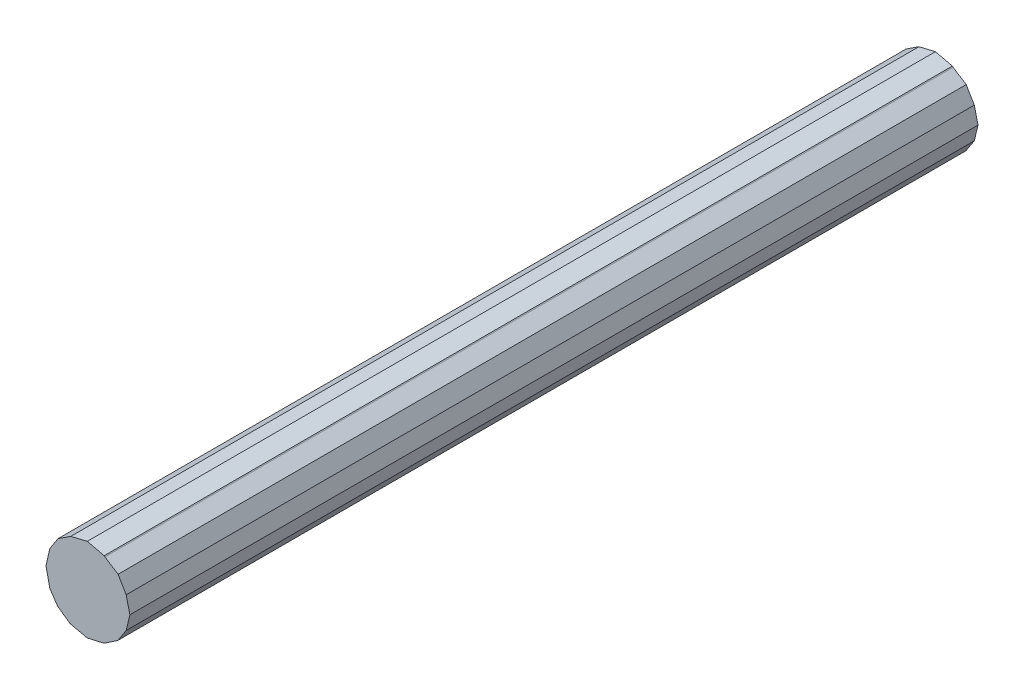
ISO-10303-21;
HEADER;
FILE_DESCRIPTION(('STEP AP214'),'2;1');
FILE_NAME('part.step','',(''),(''),'','','');
FILE_SCHEMA(('AUTOMOTIVE_DESIGN { 1 0 10303 214 1 1 1 1 }'));
ENDSEC;
DATA;
#1=APPLICATION_CONTEXT('core data for automotive mechanical design processes');
#2=APPLICATION_PROTOCOL_DEFINITION('international standard','automotive_design',2000,#1);
#3=PRODUCT_CONTEXT('',#1,'mechanical');
#4=PRODUCT('Part','Part','',(#3));
#5=PRODUCT_RELATED_PRODUCT_CATEGORY('part','',(#4));
#6=PRODUCT_DEFINITION_FORMATION('','',#4);
#7=PRODUCT_DEFINITION_CONTEXT('part definition',#1,'design');
#8=PRODUCT_DEFINITION('design','',#6,#7);
#9=PRODUCT_DEFINITION_SHAPE('','',#8);
#10=(LENGTH_UNIT() NAMED_UNIT(*) SI_UNIT(.MILLI.,.METRE.));
#11=(NAMED_UNIT(*) PLANE_ANGLE_UNIT() SI_UNIT($,.RADIAN.));
#12=(NAMED_UNIT(*) SI_UNIT($,.STERADIAN.) SOLID_ANGLE_UNIT());
#13=UNCERTAINTY_MEASURE_WITH_UNIT(LENGTH_MEASURE(1.E-05),#10,'distance_accuracy_value','');
#14=(GEOMETRIC_REPRESENTATION_CONTEXT(3) GLOBAL_UNCERTAINTY_ASSIGNED_CONTEXT((#13)) GLOBAL_UNIT_ASSIGNED_CONTEXT((#10,
#11,#12)) REPRESENTATION_CONTEXT('',''));
#15=CARTESIAN_POINT('',(0.,0.,0.));
#16=DIRECTION('',(0.,0.,1.));
#17=DIRECTION('',(1.,0.,0.));
#18=AXIS2_PLACEMENT_3D('',#15,#16,#17);
#19=CARTESIAN_POINT('',(0.5050663,0.1985264,11.20000046));
#20=DIRECTION('',(0.,0.,1.));
#21=DIRECTION('',(1.,0.,0.));
#22=AXIS2_PLACEMENT_3D('',#19,#20,#21);
#23=PLANE('',#22);
#24=DIRECTION('',(0.231653218119011,-0.972798430578044,0.));
#25=VECTOR('',#24,1.);
#26=CARTESIAN_POINT('',(0.5050663,0.1985264,11.20000046));
#27=LINE('',#26,#25);
#28=CARTESIAN_POINT('',(0.5050663,0.1985264,11.20000046));
#29=VERTEX_POINT('',#28);
#30=CARTESIAN_POINT('',(0.5537327,-0.005842,11.20000046));
#31=VERTEX_POINT('',#30);
#32=EDGE_CURVE('E228',#29,#31,#27,.T.);
#33=ORIENTED_EDGE('',*,*,#32,.F.);
#34=DIRECTION('',(0.508961233063914,-0.860789441871855,0.));
#35=VECTOR('',#34,1.);
#36=CARTESIAN_POINT('',(0.3980307,0.3795522,11.20000046));
#37=LINE('',#36,#35);
#38=CARTESIAN_POINT('',(0.3980307,0.3795522,11.20000046));
#39=VERTEX_POINT('',#38);
#40=EDGE_CURVE('E28',#39,#29,#37,.T.);
#41=ORIENTED_EDGE('',*,*,#40,.F.);
#42=DIRECTION('',(0.842148036657239,-0.539246404118153,0.));
#43=VECTOR('',#42,1.);
#44=CARTESIAN_POINT('',(0.2248027,0.490474,11.20000046));
#45=LINE('',#44,#43);
#46=CARTESIAN_POINT('',(0.2248027,0.490474,11.20000046));
#47=VERTEX_POINT('',#46);
#48=EDGE_CURVE('E263',#47,#39,#45,.T.);
#49=ORIENTED_EDGE('',*,*,#48,.F.);
#50=DIRECTION('',(0.707106781186548,-0.707106781186548,0.));
#51=VECTOR('',#50,1.);
#52=CARTESIAN_POINT('',(0.2150491,0.5002276,11.20000046));
#53=LINE('',#52,#51);
#54=CARTESIAN_POINT('',(0.2150491,0.5002276,11.20000046));
#55=VERTEX_POINT('',#54);
#56=EDGE_CURVE('E194',#55,#47,#53,.T.);
#57=ORIENTED_EDGE('',*,*,#56,.F.);
#58=DIRECTION('',(0.973544536039774,-0.228497344288947,0.));
#59=VECTOR('',#58,1.);
#60=CARTESIAN_POINT('',(-0.0087503,0.5527548,11.20000046));
#61=LINE('',#60,#59);
#62=CARTESIAN_POINT('',(-0.0087503,0.5527548,11.20000046));
#63=VERTEX_POINT('',#62);
#64=EDGE_CURVE('E206',#63,#55,#61,.T.);
#65=ORIENTED_EDGE('',*,*,#64,.F.);
#66=DIRECTION('',(0.972173014602938,0.234264017035985,0.));
#67=VECTOR('',#66,1.);
#68=CARTESIAN_POINT('',(-0.2267331,0.5002276,11.20000046));
#69=LINE('',#68,#67);
#70=CARTESIAN_POINT('',(-0.2267331,0.5002276,11.20000046));
#71=VERTEX_POINT('',#70);
#72=EDGE_CURVE('E209',#71,#63,#69,.T.);
#73=ORIENTED_EDGE('',*,*,#72,.F.);
#74=DIRECTION('',(0.837987268129986,0.545689782249991,0.));
#75=VECTOR('',#74,1.);
#76=CARTESIAN_POINT('',(-0.3941445,0.3912108,11.20000046));
#77=LINE('',#76,#75);
#78=CARTESIAN_POINT('',(-0.3941445,0.3912108,11.20000046));
#79=VERTEX_POINT('',#78);
#80=EDGE_CURVE('E276',#79,#71,#77,.T.);
#81=ORIENTED_EDGE('',*,*,#80,.F.);
#82=DIRECTION('',(0.545658634243012,0.838007550608019,0.));
#83=VECTOR('',#82,1.);
#84=CARTESIAN_POINT('',(-0.5031359,0.2238248,11.20000046));
#85=LINE('',#84,#83);
#86=CARTESIAN_POINT('',(-0.5031359,0.2238248,11.20000046));
#87=VERTEX_POINT('',#86);
#88=EDGE_CURVE('E235',#87,#79,#85,.T.);
#89=ORIENTED_EDGE('',*,*,#88,.F.);
#90=DIRECTION('',(0.220491886816933,0.975388808551702,0.));
#91=VECTOR('',#90,1.);
#92=CARTESIAN_POINT('',(-0.5537327,0.,11.20000046));
#93=LINE('',#92,#91);
#94=CARTESIAN_POINT('',(-0.5537327,0.,11.20000046));
#95=VERTEX_POINT('',#94);
#96=EDGE_CURVE('E310',#95,#87,#93,.T.);
#97=ORIENTED_EDGE('',*,*,#96,.F.);
#98=DIRECTION('',(-0.211727966137,0.977328638870001,0.));
#99=VECTOR('',#98,1.);
#100=CARTESIAN_POINT('',(-0.5031359,-0.233553,11.20000046));
#101=LINE('',#100,#99);
#102=CARTESIAN_POINT('',(-0.5031359,-0.233553,11.20000046));
#103=VERTEX_POINT('',#102);
#104=EDGE_CURVE('E154',#103,#95,#101,.T.);
#105=ORIENTED_EDGE('',*,*,#104,.F.);
#106=DIRECTION('',(-0.564292757689139,0.825574759558204,0.));
#107=VECTOR('',#106,1.);
#108=CARTESIAN_POINT('',(-0.3980307,-0.3873246,11.20000046));
#109=LINE('',#108,#107);
#110=CARTESIAN_POINT('',(-0.3980307,-0.3873246,11.20000046));
#111=VERTEX_POINT('',#110);
#112=EDGE_CURVE('E326',#111,#103,#109,.T.);
#113=ORIENTED_EDGE('',*,*,#112,.F.);
#114=DIRECTION('',(-0.818329059800928,0.57474998902595,0.));
#115=VECTOR('',#114,1.);
#116=CARTESIAN_POINT('',(-0.2345309,-0.502158,11.20000046));
#117=LINE('',#116,#115);
#118=CARTESIAN_POINT('',(-0.2345309,-0.502158,11.20000046));
#119=VERTEX_POINT('',#118);
#120=EDGE_CURVE('E256',#119,#111,#117,.T.);
#121=ORIENTED_EDGE('',*,*,#120,.F.);
#122=DIRECTION('',(-0.975388808551702,0.220491886816933,0.));
#123=VECTOR('',#122,1.);
#124=CARTESIAN_POINT('',(-0.0107061,-0.5527548,11.20000046));
#125=LINE('',#124,#123);
#126=CARTESIAN_POINT('',(-0.0107061,-0.5527548,11.20000046));
#127=VERTEX_POINT('',#126);
#128=EDGE_CURVE('E258',#127,#119,#125,.T.);
#129=ORIENTED_EDGE('',*,*,#128,.F.);
#130=DIRECTION('',(-0.975388808551702,-0.220491886816933,0.));
#131=VECTOR('',#130,1.);
#132=CARTESIAN_POINT('',(0.2131187,-0.502158,11.20000046));
#133=LINE('',#132,#131);
#134=CARTESIAN_POINT('',(0.2131187,-0.502158,11.20000046));
#135=VERTEX_POINT('',#134);
#136=EDGE_CURVE('E319',#135,#127,#133,.T.);
#137=ORIENTED_EDGE('',*,*,#136,.F.);
#138=DIRECTION('',(-0.827880404697028,-0.560904658136019,0.));
#139=VECTOR('',#138,1.);
#140=CARTESIAN_POINT('',(0.3941191,-0.3795268,11.20000046));
#141=LINE('',#140,#139);
#142=CARTESIAN_POINT('',(0.3941191,-0.3795268,11.20000046));
#143=VERTEX_POINT('',#142);
#144=EDGE_CURVE('E294',#143,#135,#141,.T.);
#145=ORIENTED_EDGE('',*,*,#144,.F.);
#146=DIRECTION('',(-0.548080747546029,-0.836425426544044,0.));
#147=VECTOR('',#146,1.);
#148=CARTESIAN_POINT('',(0.5050663,-0.2102104,11.20000046));
#149=LINE('',#148,#147);
#150=CARTESIAN_POINT('',(0.5050663,-0.2102104,11.20000046));
#151=VERTEX_POINT('',#150);
#152=EDGE_CURVE('E250',#151,#143,#149,.T.);
#153=ORIENTED_EDGE('',*,*,#152,.F.);
#154=DIRECTION('',(-0.231653218119011,-0.972798430578044,0.));
#155=VECTOR('',#154,1.);
#156=CARTESIAN_POINT('',(0.5537327,-0.005842,11.20000046));
#157=LINE('',#156,#155);
#158=EDGE_CURVE('E231',#31,#151,#157,.T.);
#159=ORIENTED_EDGE('',*,*,#158,.F.);
#160=EDGE_LOOP('',(#33,#41,#49,#57,#65,#73,#81,#89,#97,#105,#113,#121,#129,#137,#145,#153,#159));
#161=FACE_BOUND('',#160,.T.);
#162=ADVANCED_FACE('F17',(#161),#23,.T.);
#163=CARTESIAN_POINT('',(0.5050663,0.1985264,0.));
#164=DIRECTION('',(0.,0.,1.));
#165=DIRECTION('',(1.,0.,0.));
#166=AXIS2_PLACEMENT_3D('',#163,#164,#165);
#167=PLANE('',#166);
#168=DIRECTION('',(0.231653218119011,-0.972798430578044,0.));
#169=VECTOR('',#168,1.);
#170=CARTESIAN_POINT('',(0.5050663,0.1985264,0.));
#171=LINE('',#170,#169);
#172=CARTESIAN_POINT('',(0.5050663,0.1985264,0.));
#173=VERTEX_POINT('',#172);
#174=CARTESIAN_POINT('',(0.5537327,-0.005842,0.));
#175=VERTEX_POINT('',#174);
#176=EDGE_CURVE('E227',#173,#175,#171,.T.);
#177=ORIENTED_EDGE('',*,*,#176,.T.);
#178=DIRECTION('',(-0.231653218119011,-0.972798430578044,0.));
#179=VECTOR('',#178,1.);
#180=CARTESIAN_POINT('',(0.5537327,-0.005842,0.));
#181=LINE('',#180,#179);
#182=CARTESIAN_POINT('',(0.5050663,-0.2102104,0.));
#183=VERTEX_POINT('',#182);
#184=EDGE_CURVE('E246',#175,#183,#181,.T.);
#185=ORIENTED_EDGE('',*,*,#184,.T.);
#186=DIRECTION('',(-0.548080747546029,-0.836425426544044,0.));
#187=VECTOR('',#186,1.);
#188=CARTESIAN_POINT('',(0.5050663,-0.2102104,0.));
#189=LINE('',#188,#187);
#190=CARTESIAN_POINT('',(0.3941191,-0.3795268,0.));
#191=VERTEX_POINT('',#190);
#192=EDGE_CURVE('E299',#183,#191,#189,.T.);
#193=ORIENTED_EDGE('',*,*,#192,.T.);
#194=DIRECTION('',(-0.827880404697028,-0.560904658136019,0.));
#195=VECTOR('',#194,1.);
#196=CARTESIAN_POINT('',(0.3941191,-0.3795268,0.));
#197=LINE('',#196,#195);
#198=CARTESIAN_POINT('',(0.2131187,-0.502158,0.));
#199=VERTEX_POINT('',#198);
#200=EDGE_CURVE('E318',#191,#199,#197,.T.);
#201=ORIENTED_EDGE('',*,*,#200,.T.);
#202=DIRECTION('',(-0.975388808551702,-0.220491886816933,0.));
#203=VECTOR('',#202,1.);
#204=CARTESIAN_POINT('',(0.2131187,-0.502158,0.));
#205=LINE('',#204,#203);
#206=CARTESIAN_POINT('',(-0.0107061,-0.5527548,0.));
#207=VERTEX_POINT('',#206);
#208=EDGE_CURVE('E262',#199,#207,#205,.T.);
#209=ORIENTED_EDGE('',*,*,#208,.T.);
#210=DIRECTION('',(-0.975388808551702,0.220491886816933,0.));
#211=VECTOR('',#210,1.);
#212=CARTESIAN_POINT('',(-0.0107061,-0.5527548,0.));
#213=LINE('',#212,#211);
#214=CARTESIAN_POINT('',(-0.2345309,-0.502158,0.));
#215=VERTEX_POINT('',#214);
#216=EDGE_CURVE('E252',#207,#215,#213,.T.);
#217=ORIENTED_EDGE('',*,*,#216,.T.);
#218=DIRECTION('',(-0.818329059800928,0.57474998902595,0.));
#219=VECTOR('',#218,1.);
#220=CARTESIAN_POINT('',(-0.2345309,-0.502158,0.));
#221=LINE('',#220,#219);
#222=CARTESIAN_POINT('',(-0.3980307,-0.3873246,0.));
#223=VERTEX_POINT('',#222);
#224=EDGE_CURVE('E330',#215,#223,#221,.T.);
#225=ORIENTED_EDGE('',*,*,#224,.T.);
#226=DIRECTION('',(-0.564292757689139,0.825574759558204,0.));
#227=VECTOR('',#226,1.);
#228=CARTESIAN_POINT('',(-0.3980307,-0.3873246,0.));
#229=LINE('',#228,#227);
#230=CARTESIAN_POINT('',(-0.5031359,-0.233553,0.));
#231=VERTEX_POINT('',#230);
#232=EDGE_CURVE('E166',#223,#231,#229,.T.);
#233=ORIENTED_EDGE('',*,*,#232,.T.);
#234=DIRECTION('',(-0.211727966137,0.977328638870001,0.));
#235=VECTOR('',#234,1.);
#236=CARTESIAN_POINT('',(-0.5031359,-0.233553,0.));
#237=LINE('',#236,#235);
#238=CARTESIAN_POINT('',(-0.5537327,0.,0.));
#239=VERTEX_POINT('',#238);
#240=EDGE_CURVE('E245',#231,#239,#237,.T.);
#241=ORIENTED_EDGE('',*,*,#240,.T.);
#242=DIRECTION('',(0.220491886816933,0.975388808551702,0.));
#243=VECTOR('',#242,1.);
#244=CARTESIAN_POINT('',(-0.5537327,0.,0.));
#245=LINE('',#244,#243);
#246=CARTESIAN_POINT('',(-0.5031359,0.2238248,0.));
#247=VERTEX_POINT('',#246);
#248=EDGE_CURVE('E240',#239,#247,#245,.T.);
#249=ORIENTED_EDGE('',*,*,#248,.T.);
#250=DIRECTION('',(0.545658634243012,0.838007550608019,0.));
#251=VECTOR('',#250,1.);
#252=CARTESIAN_POINT('',(-0.5031359,0.2238248,0.));
#253=LINE('',#252,#251);
#254=CARTESIAN_POINT('',(-0.3941445,0.3912108,0.));
#255=VERTEX_POINT('',#254);
#256=EDGE_CURVE('E21',#247,#255,#253,.T.);
#257=ORIENTED_EDGE('',*,*,#256,.T.);
#258=DIRECTION('',(0.837987268129986,0.545689782249991,0.));
#259=VECTOR('',#258,1.);
#260=CARTESIAN_POINT('',(-0.3941445,0.3912108,0.));
#261=LINE('',#260,#259);
#262=CARTESIAN_POINT('',(-0.2267331,0.5002276,0.));
#263=VERTEX_POINT('',#262);
#264=EDGE_CURVE('E201',#255,#263,#261,.T.);
#265=ORIENTED_EDGE('',*,*,#264,.T.);
#266=DIRECTION('',(0.972173014602938,0.234264017035985,0.));
#267=VECTOR('',#266,1.);
#268=CARTESIAN_POINT('',(-0.2267331,0.5002276,0.));
#269=LINE('',#268,#267);
#270=CARTESIAN_POINT('',(-0.0087503,0.5527548,0.));
#271=VERTEX_POINT('',#270);
#272=EDGE_CURVE('E197',#263,#271,#269,.T.);
#273=ORIENTED_EDGE('',*,*,#272,.T.);
#274=DIRECTION('',(0.973544536039774,-0.228497344288947,0.));
#275=VECTOR('',#274,1.);
#276=CARTESIAN_POINT('',(-0.0087503,0.5527548,0.));
#277=LINE('',#276,#275);
#278=CARTESIAN_POINT('',(0.2150491,0.5002276,0.));
#279=VERTEX_POINT('',#278);
#280=EDGE_CURVE('E183',#271,#279,#277,.T.);
#281=ORIENTED_EDGE('',*,*,#280,.T.);
#282=DIRECTION('',(0.707106781186548,-0.707106781186548,0.));
#283=VECTOR('',#282,1.);
#284=CARTESIAN_POINT('',(0.2150491,0.5002276,0.));
#285=LINE('',#284,#283);
#286=CARTESIAN_POINT('',(0.2248027,0.490474,0.));
#287=VERTEX_POINT('',#286);
#288=EDGE_CURVE('E267',#279,#287,#285,.T.);
#289=ORIENTED_EDGE('',*,*,#288,.T.);
#290=DIRECTION('',(0.842148036657239,-0.539246404118153,0.));
#291=VECTOR('',#290,1.);
#292=CARTESIAN_POINT('',(0.2248027,0.490474,0.));
#293=LINE('',#292,#291);
#294=CARTESIAN_POINT('',(0.3980307,0.3795522,0.));
#295=VERTEX_POINT('',#294);
#296=EDGE_CURVE('E331',#287,#295,#293,.T.);
#297=ORIENTED_EDGE('',*,*,#296,.T.);
#298=DIRECTION('',(0.508961233063914,-0.860789441871855,0.));
#299=VECTOR('',#298,1.);
#300=CARTESIAN_POINT('',(0.3980307,0.3795522,0.));
#301=LINE('',#300,#299);
#302=EDGE_CURVE('E11',#295,#173,#301,.T.);
#303=ORIENTED_EDGE('',*,*,#302,.T.);
#304=EDGE_LOOP('',(#177,#185,#193,#201,#209,#217,#225,#233,#241,#249,#257,#265,#273,#281,#289,
#297,#303));
#305=FACE_BOUND('',#304,.T.);
#306=ADVANCED_FACE('F199',(#305),#167,.F.);
#307=CARTESIAN_POINT('',(0.3980307,0.3795522,0.));
#308=DIRECTION('',(0.860789441871855,0.508961233063914,0.));
#309=DIRECTION('',(0.,0.,-1.));
#310=AXIS2_PLACEMENT_3D('',#307,#308,#309);
#311=PLANE('',#310);
#312=DIRECTION('',(0.,0.,1.));
#313=VECTOR('',#312,1.);
#314=CARTESIAN_POINT('',(0.3980307,0.3795522,0.));
#315=LINE('',#314,#313);
#316=EDGE_CURVE('E266',#295,#39,#315,.T.);
#317=ORIENTED_EDGE('',*,*,#316,.T.);
#318=ORIENTED_EDGE('',*,*,#40,.T.);
#319=DIRECTION('',(0.,0.,1.));
#320=VECTOR('',#319,1.);
#321=CARTESIAN_POINT('',(0.5050663,0.1985264,0.));
#322=LINE('',#321,#320);
#323=EDGE_CURVE('E306',#173,#29,#322,.T.);
#324=ORIENTED_EDGE('',*,*,#323,.F.);
#325=ORIENTED_EDGE('',*,*,#302,.F.);
#326=EDGE_LOOP('',(#317,#318,#324,#325));
#327=FACE_BOUND('',#326,.T.);
#328=ADVANCED_FACE('F587',(#327),#311,.T.);
#329=CARTESIAN_POINT('',(0.2248027,0.490474,0.));
#330=DIRECTION('',(0.539246404118153,0.842148036657239,0.));
#331=DIRECTION('',(0.,0.,-1.));
#332=AXIS2_PLACEMENT_3D('',#329,#330,#331);
#333=PLANE('',#332);
#334=DIRECTION('',(0.,0.,1.));
#335=VECTOR('',#334,1.);
#336=CARTESIAN_POINT('',(0.2248027,0.490474,0.));
#337=LINE('',#336,#335);
#338=EDGE_CURVE('E302',#287,#47,#337,.T.);
#339=ORIENTED_EDGE('',*,*,#338,.T.);
#340=ORIENTED_EDGE('',*,*,#48,.T.);
#341=ORIENTED_EDGE('',*,*,#316,.F.);
#342=ORIENTED_EDGE('',*,*,#296,.F.);
#343=EDGE_LOOP('',(#339,#340,#341,#342));
#344=FACE_BOUND('',#343,.T.);
#345=ADVANCED_FACE('F348',(#344),#333,.T.);
#346=CARTESIAN_POINT('',(0.2150491,0.5002276,0.));
#347=DIRECTION('',(0.707106781186548,0.707106781186548,0.));
#348=DIRECTION('',(0.,0.,-1.));
#349=AXIS2_PLACEMENT_3D('',#346,#347,#348);
#350=PLANE('',#349);
#351=DIRECTION('',(0.,0.,1.));
#352=VECTOR('',#351,1.);
#353=CARTESIAN_POINT('',(0.2150491,0.5002276,0.));
#354=LINE('',#353,#352);
#355=EDGE_CURVE('E190',#279,#55,#354,.T.);
#356=ORIENTED_EDGE('',*,*,#355,.T.);
#357=ORIENTED_EDGE('',*,*,#56,.T.);
#358=ORIENTED_EDGE('',*,*,#338,.F.);
#359=ORIENTED_EDGE('',*,*,#288,.F.);
#360=EDGE_LOOP('',(#356,#357,#358,#359));
#361=FACE_BOUND('',#360,.T.);
#362=ADVANCED_FACE('F342',(#361),#350,.T.);
#363=CARTESIAN_POINT('',(-0.0087503,0.5527548,0.));
#364=DIRECTION('',(0.228497344288947,0.973544536039774,0.));
#365=DIRECTION('',(0.,0.,-1.));
#366=AXIS2_PLACEMENT_3D('',#363,#364,#365);
#367=PLANE('',#366);
#368=DIRECTION('',(0.,0.,1.));
#369=VECTOR('',#368,1.);
#370=CARTESIAN_POINT('',(-0.0087503,0.5527548,0.));
#371=LINE('',#370,#369);
#372=EDGE_CURVE('E187',#271,#63,#371,.T.);
#373=ORIENTED_EDGE('',*,*,#372,.T.);
#374=ORIENTED_EDGE('',*,*,#64,.T.);
#375=ORIENTED_EDGE('',*,*,#355,.F.);
#376=ORIENTED_EDGE('',*,*,#280,.F.);
#377=EDGE_LOOP('',(#373,#374,#375,#376));
#378=FACE_BOUND('',#377,.T.);
#379=ADVANCED_FACE('F19',(#378),#367,.T.);
#380=CARTESIAN_POINT('',(-0.2267331,0.5002276,0.));
#381=DIRECTION('',(-0.234264017035985,0.972173014602938,0.));
#382=DIRECTION('',(0.,0.,1.));
#383=AXIS2_PLACEMENT_3D('',#380,#381,#382);
#384=PLANE('',#383);
#385=DIRECTION('',(0.,0.,1.));
#386=VECTOR('',#385,1.);
#387=CARTESIAN_POINT('',(-0.2267331,0.5002276,0.));
#388=LINE('',#387,#386);
#389=EDGE_CURVE('E219',#263,#71,#388,.T.);
#390=ORIENTED_EDGE('',*,*,#389,.T.);
#391=ORIENTED_EDGE('',*,*,#72,.T.);
#392=ORIENTED_EDGE('',*,*,#372,.F.);
#393=ORIENTED_EDGE('',*,*,#272,.F.);
#394=EDGE_LOOP('',(#390,#391,#392,#393));
#395=FACE_BOUND('',#394,.T.);
#396=ADVANCED_FACE('F208',(#395),#384,.T.);
#397=CARTESIAN_POINT('',(-0.3941445,0.3912108,0.));
#398=DIRECTION('',(-0.545689782249991,0.837987268129986,0.));
#399=DIRECTION('',(0.,0.,1.));
#400=AXIS2_PLACEMENT_3D('',#397,#398,#399);
#401=PLANE('',#400);
#402=DIRECTION('',(0.,0.,1.));
#403=VECTOR('',#402,1.);
#404=CARTESIAN_POINT('',(-0.3941445,0.3912108,0.));
#405=LINE('',#404,#403);
#406=EDGE_CURVE('E239',#255,#79,#405,.T.);
#407=ORIENTED_EDGE('',*,*,#406,.T.);
#408=ORIENTED_EDGE('',*,*,#80,.T.);
#409=ORIENTED_EDGE('',*,*,#389,.F.);
#410=ORIENTED_EDGE('',*,*,#264,.F.);
#411=EDGE_LOOP('',(#407,#408,#409,#410));
#412=FACE_BOUND('',#411,.T.);
#413=ADVANCED_FACE('F597',(#412),#401,.T.);
#414=CARTESIAN_POINT('',(-0.5031359,0.2238248,0.));
#415=DIRECTION('',(-0.838007550608019,0.545658634243012,0.));
#416=DIRECTION('',(0.,0.,1.));
#417=AXIS2_PLACEMENT_3D('',#414,#415,#416);
#418=PLANE('',#417);
#419=DIRECTION('',(0.,0.,1.));
#420=VECTOR('',#419,1.);
#421=CARTESIAN_POINT('',(-0.5031359,0.2238248,0.));
#422=LINE('',#421,#420);
#423=EDGE_CURVE('E385',#247,#87,#422,.T.);
#424=ORIENTED_EDGE('',*,*,#423,.T.);
#425=ORIENTED_EDGE('',*,*,#88,.T.);
#426=ORIENTED_EDGE('',*,*,#406,.F.);
#427=ORIENTED_EDGE('',*,*,#256,.F.);
#428=EDGE_LOOP('',(#424,#425,#426,#427));
#429=FACE_BOUND('',#428,.T.);
#430=ADVANCED_FACE('F400',(#429),#418,.T.);
#431=CARTESIAN_POINT('',(-0.5537327,0.,0.));
#432=DIRECTION('',(-0.975388808551702,0.220491886816933,0.));
#433=DIRECTION('',(0.,0.,1.));
#434=AXIS2_PLACEMENT_3D('',#431,#432,#433);
#435=PLANE('',#434);
#436=DIRECTION('',(0.,0.,1.));
#437=VECTOR('',#436,1.);
#438=CARTESIAN_POINT('',(-0.5537327,0.,0.));
#439=LINE('',#438,#437);
#440=EDGE_CURVE('E241',#239,#95,#439,.T.);
#441=ORIENTED_EDGE('',*,*,#440,.T.);
#442=ORIENTED_EDGE('',*,*,#96,.T.);
#443=ORIENTED_EDGE('',*,*,#423,.F.);
#444=ORIENTED_EDGE('',*,*,#248,.F.);
#445=EDGE_LOOP('',(#441,#442,#443,#444));
#446=FACE_BOUND('',#445,.T.);
#447=ADVANCED_FACE('F398',(#446),#435,.T.);
#448=CARTESIAN_POINT('',(-0.5031359,-0.233553,0.));
#449=DIRECTION('',(-0.977328638870001,-0.211727966137,0.));
#450=DIRECTION('',(-0.211727966137,0.977328638870001,0.));
#451=AXIS2_PLACEMENT_3D('',#448,#449,#450);
#452=PLANE('',#451);
#453=DIRECTION('',(0.,0.,1.));
#454=VECTOR('',#453,1.);
#455=CARTESIAN_POINT('',(-0.5031359,-0.233553,0.));
#456=LINE('',#455,#454);
#457=EDGE_CURVE('E234',#231,#103,#456,.T.);
#458=ORIENTED_EDGE('',*,*,#457,.T.);
#459=ORIENTED_EDGE('',*,*,#104,.T.);
#460=ORIENTED_EDGE('',*,*,#440,.F.);
#461=ORIENTED_EDGE('',*,*,#240,.F.);
#462=EDGE_LOOP('',(#458,#459,#460,#461));
#463=FACE_BOUND('',#462,.T.);
#464=ADVANCED_FACE('F402',(#463),#452,.T.);
#465=CARTESIAN_POINT('',(-0.3980307,-0.3873246,0.));
#466=DIRECTION('',(-0.825574759558204,-0.564292757689139,0.));
#467=DIRECTION('',(-0.564292757689139,0.825574759558204,0.));
#468=AXIS2_PLACEMENT_3D('',#465,#466,#467);
#469=PLANE('',#468);
#470=DIRECTION('',(0.,0.,1.));
#471=VECTOR('',#470,1.);
#472=CARTESIAN_POINT('',(-0.3980307,-0.3873246,0.));
#473=LINE('',#472,#471);
#474=EDGE_CURVE('E367',#223,#111,#473,.T.);
#475=ORIENTED_EDGE('',*,*,#474,.T.);
#476=ORIENTED_EDGE('',*,*,#112,.T.);
#477=ORIENTED_EDGE('',*,*,#457,.F.);
#478=ORIENTED_EDGE('',*,*,#232,.F.);
#479=EDGE_LOOP('',(#475,#476,#477,#478));
#480=FACE_BOUND('',#479,.T.);
#481=ADVANCED_FACE('F404',(#480),#469,.T.);
#482=CARTESIAN_POINT('',(-0.2345309,-0.502158,0.));
#483=DIRECTION('',(-0.57474998902595,-0.818329059800928,0.));
#484=DIRECTION('',(-0.818329059800928,0.57474998902595,0.));
#485=AXIS2_PLACEMENT_3D('',#482,#483,#484);
#486=PLANE('',#485);
#487=DIRECTION('',(0.,0.,1.));
#488=VECTOR('',#487,1.);
#489=CARTESIAN_POINT('',(-0.2345309,-0.502158,0.));
#490=LINE('',#489,#488);
#491=EDGE_CURVE('E257',#215,#119,#490,.T.);
#492=ORIENTED_EDGE('',*,*,#491,.T.);
#493=ORIENTED_EDGE('',*,*,#120,.T.);
#494=ORIENTED_EDGE('',*,*,#474,.F.);
#495=ORIENTED_EDGE('',*,*,#224,.F.);
#496=EDGE_LOOP('',(#492,#493,#494,#495));
#497=FACE_BOUND('',#496,.T.);
#498=ADVANCED_FACE('F407',(#497),#486,.T.);
#499=CARTESIAN_POINT('',(-0.0107061,-0.5527548,0.));
#500=DIRECTION('',(-0.220491886816933,-0.975388808551702,0.));
#501=DIRECTION('',(-0.975388808551702,0.220491886816933,0.));
#502=AXIS2_PLACEMENT_3D('',#499,#500,#501);
#503=PLANE('',#502);
#504=DIRECTION('',(0.,0.,1.));
#505=VECTOR('',#504,1.);
#506=CARTESIAN_POINT('',(-0.0107061,-0.5527548,0.));
#507=LINE('',#506,#505);
#508=EDGE_CURVE('E314',#207,#127,#507,.T.);
#509=ORIENTED_EDGE('',*,*,#508,.T.);
#510=ORIENTED_EDGE('',*,*,#128,.T.);
#511=ORIENTED_EDGE('',*,*,#491,.F.);
#512=ORIENTED_EDGE('',*,*,#216,.F.);
#513=EDGE_LOOP('',(#509,#510,#511,#512));
#514=FACE_BOUND('',#513,.T.);
#515=ADVANCED_FACE('F410',(#514),#503,.T.);
#516=CARTESIAN_POINT('',(0.2131187,-0.502158,0.));
#517=DIRECTION('',(0.220491886816933,-0.975388808551702,0.));
#518=DIRECTION('',(0.,0.,-1.));
#519=AXIS2_PLACEMENT_3D('',#516,#517,#518);
#520=PLANE('',#519);
#521=DIRECTION('',(0.,0.,1.));
#522=VECTOR('',#521,1.);
#523=CARTESIAN_POINT('',(0.2131187,-0.502158,0.));
#524=LINE('',#523,#522);
#525=EDGE_CURVE('E298',#199,#135,#524,.T.);
#526=ORIENTED_EDGE('',*,*,#525,.T.);
#527=ORIENTED_EDGE('',*,*,#136,.T.);
#528=ORIENTED_EDGE('',*,*,#508,.F.);
#529=ORIENTED_EDGE('',*,*,#208,.F.);
#530=EDGE_LOOP('',(#526,#527,#528,#529));
#531=FACE_BOUND('',#530,.T.);
#532=ADVANCED_FACE('F413',(#531),#520,.T.);
#533=CARTESIAN_POINT('',(0.3941191,-0.3795268,0.));
#534=DIRECTION('',(0.560904658136019,-0.827880404697028,0.));
#535=DIRECTION('',(0.,0.,-1.));
#536=AXIS2_PLACEMENT_3D('',#533,#534,#535);
#537=PLANE('',#536);
#538=DIRECTION('',(0.,0.,1.));
#539=VECTOR('',#538,1.);
#540=CARTESIAN_POINT('',(0.3941191,-0.3795268,0.));
#541=LINE('',#540,#539);
#542=EDGE_CURVE('E291',#191,#143,#541,.T.);
#543=ORIENTED_EDGE('',*,*,#542,.T.);
#544=ORIENTED_EDGE('',*,*,#144,.T.);
#545=ORIENTED_EDGE('',*,*,#525,.F.);
#546=ORIENTED_EDGE('',*,*,#200,.F.);
#547=EDGE_LOOP('',(#543,#544,#545,#546));
#548=FACE_BOUND('',#547,.T.);
#549=ADVANCED_FACE('F418',(#548),#537,.T.);
#550=CARTESIAN_POINT('',(0.5050663,-0.2102104,0.));
#551=DIRECTION('',(0.836425426544044,-0.548080747546029,0.));
#552=DIRECTION('',(0.,0.,-1.));
#553=AXIS2_PLACEMENT_3D('',#550,#551,#552);
#554=PLANE('',#553);
#555=DIRECTION('',(0.,0.,1.));
#556=VECTOR('',#555,1.);
#557=CARTESIAN_POINT('',(0.5050663,-0.2102104,0.));
#558=LINE('',#557,#556);
#559=EDGE_CURVE('E251',#183,#151,#558,.T.);
#560=ORIENTED_EDGE('',*,*,#559,.T.);
#561=ORIENTED_EDGE('',*,*,#152,.T.);
#562=ORIENTED_EDGE('',*,*,#542,.F.);
#563=ORIENTED_EDGE('',*,*,#192,.F.);
#564=EDGE_LOOP('',(#560,#561,#562,#563));
#565=FACE_BOUND('',#564,.T.);
#566=ADVANCED_FACE('F422',(#565),#554,.T.);
#567=CARTESIAN_POINT('',(0.5537327,-0.005842,0.));
#568=DIRECTION('',(0.972798430578044,-0.231653218119011,0.));
#569=DIRECTION('',(0.,0.,-1.));
#570=AXIS2_PLACEMENT_3D('',#567,#568,#569);
#571=PLANE('',#570);
#572=DIRECTION('',(0.,0.,1.));
#573=VECTOR('',#572,1.);
#574=CARTESIAN_POINT('',(0.5537327,-0.005842,0.));
#575=LINE('',#574,#573);
#576=EDGE_CURVE('E223',#175,#31,#575,.T.);
#577=ORIENTED_EDGE('',*,*,#576,.T.);
#578=ORIENTED_EDGE('',*,*,#158,.T.);
#579=ORIENTED_EDGE('',*,*,#559,.F.);
#580=ORIENTED_EDGE('',*,*,#184,.F.);
#581=EDGE_LOOP('',(#577,#578,#579,#580));
#582=FACE_BOUND('',#581,.T.);
#583=ADVANCED_FACE('F425',(#582),#571,.T.);
#584=CARTESIAN_POINT('',(0.5050663,0.1985264,0.));
#585=DIRECTION('',(0.972798430578044,0.231653218119011,0.));
#586=DIRECTION('',(0.,0.,-1.));
#587=AXIS2_PLACEMENT_3D('',#584,#585,#586);
#588=PLANE('',#587);
#589=ORIENTED_EDGE('',*,*,#323,.T.);
#590=ORIENTED_EDGE('',*,*,#32,.T.);
#591=ORIENTED_EDGE('',*,*,#576,.F.);
#592=ORIENTED_EDGE('',*,*,#176,.F.);
#593=EDGE_LOOP('',(#589,#590,#591,#592));
#594=FACE_BOUND('',#593,.T.);
#595=ADVANCED_FACE('F430',(#594),#588,.T.);
#596=CLOSED_SHELL('',(#162,#306,#328,#345,#362,#379,#396,#413,#430,#447,#464,#481,#498,#515,
#532,#549,#566,#583,#595));
#597=MANIFOLD_SOLID_BREP('B1',#596);
#598=ADVANCED_BREP_SHAPE_REPRESENTATION('',(#18,#597),#14);
#599=SHAPE_DEFINITION_REPRESENTATION(#9,#598);
ENDSEC;
END-ISO-10303-21;
